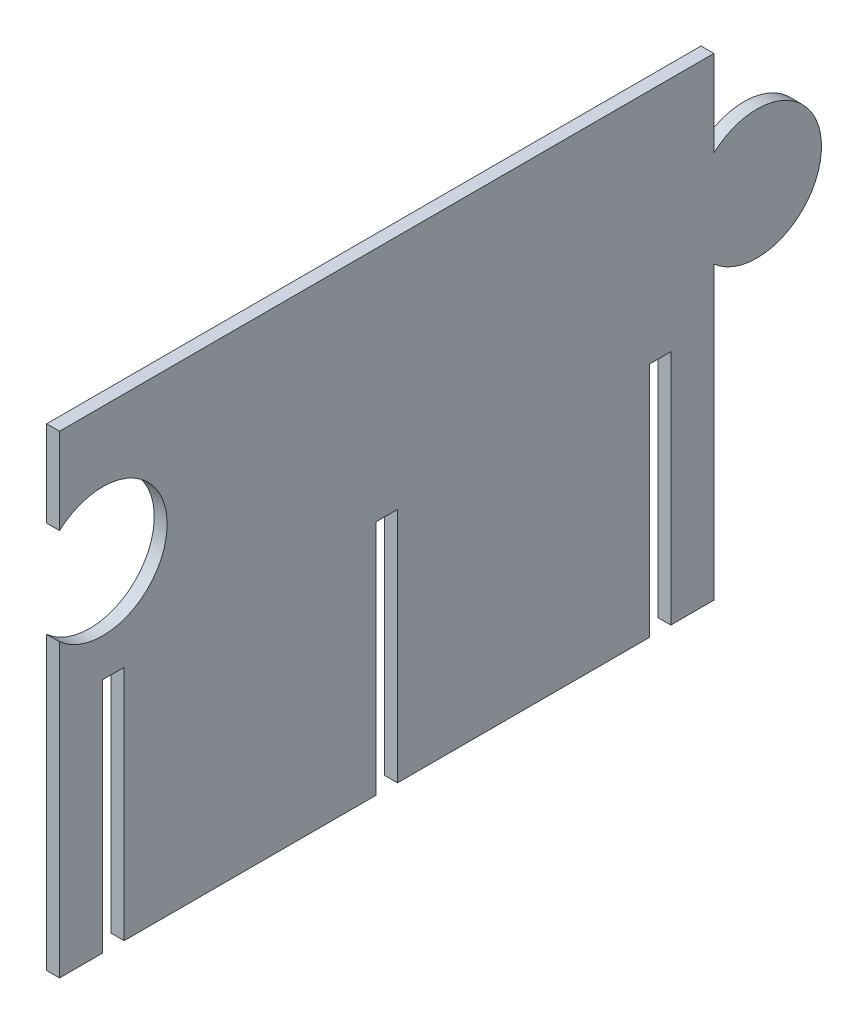
ISO-10303-21;
HEADER;
FILE_DESCRIPTION(('STEP AP214'),'2;1');
FILE_NAME('part.step','',(''),(''),'','','');
FILE_SCHEMA(('AUTOMOTIVE_DESIGN { 1 0 10303 214 1 1 1 1 }'));
ENDSEC;
DATA;
#1=APPLICATION_CONTEXT('core data for automotive mechanical design processes');
#2=APPLICATION_PROTOCOL_DEFINITION('international standard','automotive_design',2000,#1);
#3=PRODUCT_CONTEXT('',#1,'mechanical');
#4=PRODUCT('Part','Part','',(#3));
#5=PRODUCT_RELATED_PRODUCT_CATEGORY('part','',(#4));
#6=PRODUCT_DEFINITION_FORMATION('','',#4);
#7=PRODUCT_DEFINITION_CONTEXT('part definition',#1,'design');
#8=PRODUCT_DEFINITION('design','',#6,#7);
#9=PRODUCT_DEFINITION_SHAPE('','',#8);
#10=(LENGTH_UNIT() NAMED_UNIT(*) SI_UNIT(.MILLI.,.METRE.));
#11=(NAMED_UNIT(*) PLANE_ANGLE_UNIT() SI_UNIT($,.RADIAN.));
#12=(NAMED_UNIT(*) SI_UNIT($,.STERADIAN.) SOLID_ANGLE_UNIT());
#13=UNCERTAINTY_MEASURE_WITH_UNIT(LENGTH_MEASURE(1.E-05),#10,'distance_accuracy_value','');
#14=(GEOMETRIC_REPRESENTATION_CONTEXT(3) GLOBAL_UNCERTAINTY_ASSIGNED_CONTEXT((#13)) GLOBAL_UNIT_ASSIGNED_CONTEXT((#10,
#11,#12)) REPRESENTATION_CONTEXT('',''));
#15=CARTESIAN_POINT('',(0.,0.,0.));
#16=DIRECTION('',(0.,0.,1.));
#17=DIRECTION('',(1.,0.,0.));
#18=AXIS2_PLACEMENT_3D('',#15,#16,#17);
#19=CARTESIAN_POINT('',(3.,55.9300406372922,-141.990840374598));
#20=DIRECTION('',(-1.,0.,0.));
#21=DIRECTION('',(0.,0.,1.));
#22=AXIS2_PLACEMENT_3D('',#19,#20,#21);
#23=CYLINDRICAL_SURFACE('',#22,15.);
#24=CARTESIAN_POINT('',(0.,55.9300406372922,-141.990840374598));
#25=DIRECTION('',(-1.,0.,0.));
#26=DIRECTION('',(0.,0.,1.));
#27=AXIS2_PLACEMENT_3D('',#24,#25,#26);
#28=CIRCLE('',#27,15.);
#29=CARTESIAN_POINT('',(0.,67.1103805247912,-131.990840374598));
#30=VERTEX_POINT('',#29);
#31=CARTESIAN_POINT('',(0.,44.7497007497933,-131.990840374598));
#32=VERTEX_POINT('',#31);
#33=EDGE_CURVE('E200',#30,#32,#28,.T.);
#34=ORIENTED_EDGE('',*,*,#33,.F.);
#35=DIRECTION('',(-1.,0.,0.));
#36=VECTOR('',#35,1.);
#37=CARTESIAN_POINT('',(3.,67.1103805247912,-131.990840374598));
#38=LINE('',#37,#36);
#39=CARTESIAN_POINT('',(3.,67.1103805247912,-131.990840374598));
#40=VERTEX_POINT('',#39);
#41=EDGE_CURVE('E11',#40,#30,#38,.T.);
#42=ORIENTED_EDGE('',*,*,#41,.F.);
#43=CARTESIAN_POINT('',(3.,55.9300406372922,-141.990840374598));
#44=DIRECTION('',(-1.,0.,0.));
#45=DIRECTION('',(0.,0.,1.));
#46=AXIS2_PLACEMENT_3D('',#43,#44,#45);
#47=CIRCLE('',#46,15.);
#48=CARTESIAN_POINT('',(3.,44.7497007497933,-131.990840374598));
#49=VERTEX_POINT('',#48);
#50=EDGE_CURVE('E242',#40,#49,#47,.T.);
#51=ORIENTED_EDGE('',*,*,#50,.T.);
#52=DIRECTION('',(-1.,0.,0.));
#53=VECTOR('',#52,1.);
#54=CARTESIAN_POINT('',(3.,44.7497007497933,-131.990840374598));
#55=LINE('',#54,#53);
#56=EDGE_CURVE('E35',#49,#32,#55,.T.);
#57=ORIENTED_EDGE('',*,*,#56,.T.);
#58=EDGE_LOOP('',(#34,#42,#51,#57));
#59=FACE_BOUND('',#58,.T.);
#60=ADVANCED_FACE('F32',(#59),#23,.T.);
#61=CARTESIAN_POINT('',(3.,87.1103805247912,-131.990840374598));
#62=DIRECTION('',(0.,0.,-1.));
#63=DIRECTION('',(-1.,0.,0.));
#64=AXIS2_PLACEMENT_3D('',#61,#62,#63);
#65=PLANE('',#64);
#66=DIRECTION('',(0.,-1.,0.));
#67=VECTOR('',#66,1.);
#68=CARTESIAN_POINT('',(0.,87.1103805247912,-131.990840374598));
#69=LINE('',#68,#67);
#70=CARTESIAN_POINT('',(0.,87.1103805247912,-131.990840374598));
#71=VERTEX_POINT('',#70);
#72=EDGE_CURVE('E240',#71,#30,#69,.T.);
#73=ORIENTED_EDGE('',*,*,#72,.F.);
#74=DIRECTION('',(-1.,0.,0.));
#75=VECTOR('',#74,1.);
#76=CARTESIAN_POINT('',(3.,87.1103805247912,-131.990840374598));
#77=LINE('',#76,#75);
#78=CARTESIAN_POINT('',(3.,87.1103805247912,-131.990840374598));
#79=VERTEX_POINT('',#78);
#80=EDGE_CURVE('E41',#79,#71,#77,.T.);
#81=ORIENTED_EDGE('',*,*,#80,.F.);
#82=DIRECTION('',(0.,-1.,0.));
#83=VECTOR('',#82,1.);
#84=CARTESIAN_POINT('',(3.,87.1103805247912,-131.990840374598));
#85=LINE('',#84,#83);
#86=EDGE_CURVE('E180',#79,#40,#85,.T.);
#87=ORIENTED_EDGE('',*,*,#86,.T.);
#88=ORIENTED_EDGE('',*,*,#41,.T.);
#89=EDGE_LOOP('',(#73,#81,#87,#88));
#90=FACE_BOUND('',#89,.T.);
#91=ADVANCED_FACE('F293',(#90),#65,.T.);
#92=CARTESIAN_POINT('',(3.,87.1103805247912,-131.990840374598));
#93=DIRECTION('',(0.,-1.,0.));
#94=DIRECTION('',(0.,0.,-1.));
#95=AXIS2_PLACEMENT_3D('',#92,#93,#94);
#96=PLANE('',#95);
#97=DIRECTION('',(0.,0.,1.));
#98=VECTOR('',#97,1.);
#99=CARTESIAN_POINT('',(0.,87.1103805247912,-131.990840374598));
#100=LINE('',#99,#98);
#101=CARTESIAN_POINT('',(0.,87.1103805247911,20.0091596254017));
#102=VERTEX_POINT('',#101);
#103=EDGE_CURVE('E185',#71,#102,#100,.T.);
#104=ORIENTED_EDGE('',*,*,#103,.T.);
#105=DIRECTION('',(-1.,0.,0.));
#106=VECTOR('',#105,1.);
#107=CARTESIAN_POINT('',(3.,87.1103805247911,20.0091596254017));
#108=LINE('',#107,#106);
#109=CARTESIAN_POINT('',(3.,87.1103805247911,20.0091596254017));
#110=VERTEX_POINT('',#109);
#111=EDGE_CURVE('E183',#110,#102,#108,.T.);
#112=ORIENTED_EDGE('',*,*,#111,.F.);
#113=DIRECTION('',(0.,0.,1.));
#114=VECTOR('',#113,1.);
#115=CARTESIAN_POINT('',(3.,87.1103805247912,-131.990840374598));
#116=LINE('',#115,#114);
#117=EDGE_CURVE('E174',#79,#110,#116,.T.);
#118=ORIENTED_EDGE('',*,*,#117,.F.);
#119=ORIENTED_EDGE('',*,*,#80,.T.);
#120=EDGE_LOOP('',(#104,#112,#118,#119));
#121=FACE_BOUND('',#120,.T.);
#122=ADVANCED_FACE('F184',(#121),#96,.F.);
#123=CARTESIAN_POINT('',(3.,87.1103805247911,20.0091596254017));
#124=DIRECTION('',(0.,0.,-1.));
#125=DIRECTION('',(-1.,0.,0.));
#126=AXIS2_PLACEMENT_3D('',#123,#124,#125);
#127=PLANE('',#126);
#128=DIRECTION('',(0.,-1.,0.));
#129=VECTOR('',#128,1.);
#130=CARTESIAN_POINT('',(0.,87.1103805247911,20.0091596254017));
#131=LINE('',#130,#129);
#132=CARTESIAN_POINT('',(0.,67.1103805247911,20.0091596254017));
#133=VERTEX_POINT('',#132);
#134=EDGE_CURVE('E237',#102,#133,#131,.T.);
#135=ORIENTED_EDGE('',*,*,#134,.T.);
#136=DIRECTION('',(-1.,0.,0.));
#137=VECTOR('',#136,1.);
#138=CARTESIAN_POINT('',(3.,67.1103805247911,20.0091596254017));
#139=LINE('',#138,#137);
#140=CARTESIAN_POINT('',(3.,67.1103805247911,20.0091596254017));
#141=VERTEX_POINT('',#140);
#142=EDGE_CURVE('E188',#141,#133,#139,.T.);
#143=ORIENTED_EDGE('',*,*,#142,.F.);
#144=DIRECTION('',(0.,-1.,0.));
#145=VECTOR('',#144,1.);
#146=CARTESIAN_POINT('',(3.,87.1103805247911,20.0091596254017));
#147=LINE('',#146,#145);
#148=EDGE_CURVE('E178',#110,#141,#147,.T.);
#149=ORIENTED_EDGE('',*,*,#148,.F.);
#150=ORIENTED_EDGE('',*,*,#111,.T.);
#151=EDGE_LOOP('',(#135,#143,#149,#150));
#152=FACE_BOUND('',#151,.T.);
#153=ADVANCED_FACE('F190',(#152),#127,.F.);
#154=CARTESIAN_POINT('',(3.,55.9300406372922,10.0091596254017));
#155=DIRECTION('',(-1.,0.,0.));
#156=DIRECTION('',(0.,0.,1.));
#157=AXIS2_PLACEMENT_3D('',#154,#155,#156);
#158=CYLINDRICAL_SURFACE('',#157,15.);
#159=CARTESIAN_POINT('',(0.,55.9300406372922,10.0091596254017));
#160=DIRECTION('',(-1.,0.,0.));
#161=DIRECTION('',(0.,0.,1.));
#162=AXIS2_PLACEMENT_3D('',#159,#160,#161);
#163=CIRCLE('',#162,15.);
#164=CARTESIAN_POINT('',(0.,44.7497007497932,20.0091596254018));
#165=VERTEX_POINT('',#164);
#166=EDGE_CURVE('E235',#133,#165,#163,.T.);
#167=ORIENTED_EDGE('',*,*,#166,.T.);
#168=DIRECTION('',(-1.,0.,0.));
#169=VECTOR('',#168,1.);
#170=CARTESIAN_POINT('',(3.,44.7497007497932,20.0091596254018));
#171=LINE('',#170,#169);
#172=CARTESIAN_POINT('',(3.,44.7497007497932,20.0091596254018));
#173=VERTEX_POINT('',#172);
#174=EDGE_CURVE('E246',#173,#165,#171,.T.);
#175=ORIENTED_EDGE('',*,*,#174,.F.);
#176=CARTESIAN_POINT('',(3.,55.9300406372922,10.0091596254017));
#177=DIRECTION('',(-1.,0.,0.));
#178=DIRECTION('',(0.,0.,1.));
#179=AXIS2_PLACEMENT_3D('',#176,#177,#178);
#180=CIRCLE('',#179,15.);
#181=EDGE_CURVE('E193',#141,#173,#180,.T.);
#182=ORIENTED_EDGE('',*,*,#181,.F.);
#183=ORIENTED_EDGE('',*,*,#142,.T.);
#184=EDGE_LOOP('',(#167,#175,#182,#183));
#185=FACE_BOUND('',#184,.T.);
#186=ADVANCED_FACE('F306',(#185),#158,.F.);
#187=CARTESIAN_POINT('',(3.,44.7497007497932,20.0091596254018));
#188=DIRECTION('',(0.,0.,-1.));
#189=DIRECTION('',(0.,1.,0.));
#190=AXIS2_PLACEMENT_3D('',#187,#188,#189);
#191=PLANE('',#190);
#192=DIRECTION('',(0.,-1.,0.));
#193=VECTOR('',#192,1.);
#194=CARTESIAN_POINT('',(0.,44.7497007497932,20.0091596254018));
#195=LINE('',#194,#193);
#196=CARTESIAN_POINT('',(0.,-22.8896194752089,20.0091596254018));
#197=VERTEX_POINT('',#196);
#198=EDGE_CURVE('E233',#165,#197,#195,.T.);
#199=ORIENTED_EDGE('',*,*,#198,.T.);
#200=DIRECTION('',(-1.,0.,0.));
#201=VECTOR('',#200,1.);
#202=CARTESIAN_POINT('',(3.,-22.8896194752089,20.0091596254018));
#203=LINE('',#202,#201);
#204=CARTESIAN_POINT('',(3.,-22.8896194752089,20.0091596254018));
#205=VERTEX_POINT('',#204);
#206=EDGE_CURVE('E249',#205,#197,#203,.T.);
#207=ORIENTED_EDGE('',*,*,#206,.F.);
#208=DIRECTION('',(0.,-1.,0.));
#209=VECTOR('',#208,1.);
#210=CARTESIAN_POINT('',(3.,44.7497007497932,20.0091596254018));
#211=LINE('',#210,#209);
#212=EDGE_CURVE('E195',#173,#205,#211,.T.);
#213=ORIENTED_EDGE('',*,*,#212,.F.);
#214=ORIENTED_EDGE('',*,*,#174,.T.);
#215=EDGE_LOOP('',(#199,#207,#213,#214));
#216=FACE_BOUND('',#215,.T.);
#217=ADVANCED_FACE('F309',(#216),#191,.F.);
#218=CARTESIAN_POINT('',(3.,-22.8896194752089,20.0091596254018));
#219=DIRECTION('',(0.,1.,0.));
#220=DIRECTION('',(0.,0.,1.));
#221=AXIS2_PLACEMENT_3D('',#218,#219,#220);
#222=PLANE('',#221);
#223=DIRECTION('',(0.,0.,-1.));
#224=VECTOR('',#223,1.);
#225=CARTESIAN_POINT('',(0.,-22.8896194752089,20.0091596254018));
#226=LINE('',#225,#224);
#227=CARTESIAN_POINT('',(0.,-22.8896194752089,10.0091596254018));
#228=VERTEX_POINT('',#227);
#229=EDGE_CURVE('E231',#197,#228,#226,.T.);
#230=ORIENTED_EDGE('',*,*,#229,.T.);
#231=DIRECTION('',(-1.,0.,0.));
#232=VECTOR('',#231,1.);
#233=CARTESIAN_POINT('',(3.,-22.8896194752089,10.0091596254018));
#234=LINE('',#233,#232);
#235=CARTESIAN_POINT('',(3.,-22.8896194752089,10.0091596254018));
#236=VERTEX_POINT('',#235);
#237=EDGE_CURVE('E252',#236,#228,#234,.T.);
#238=ORIENTED_EDGE('',*,*,#237,.F.);
#239=DIRECTION('',(0.,0.,-1.));
#240=VECTOR('',#239,1.);
#241=CARTESIAN_POINT('',(3.,-22.8896194752089,20.0091596254018));
#242=LINE('',#241,#240);
#243=EDGE_CURVE('E546',#205,#236,#242,.T.);
#244=ORIENTED_EDGE('',*,*,#243,.F.);
#245=ORIENTED_EDGE('',*,*,#206,.T.);
#246=EDGE_LOOP('',(#230,#238,#244,#245));
#247=FACE_BOUND('',#246,.T.);
#248=ADVANCED_FACE('F313',(#247),#222,.F.);
#249=CARTESIAN_POINT('',(3.,-22.8896194752089,10.0091596254018));
#250=DIRECTION('',(0.,0.,1.));
#251=DIRECTION('',(0.,-1.,0.));
#252=AXIS2_PLACEMENT_3D('',#249,#250,#251);
#253=PLANE('',#252);
#254=DIRECTION('',(0.,1.,0.));
#255=VECTOR('',#254,1.);
#256=CARTESIAN_POINT('',(0.,-22.8896194752089,10.0091596254018));
#257=LINE('',#256,#255);
#258=CARTESIAN_POINT('',(0.,32.1103805247911,10.0091596254018));
#259=VERTEX_POINT('',#258);
#260=EDGE_CURVE('E229',#228,#259,#257,.T.);
#261=ORIENTED_EDGE('',*,*,#260,.T.);
#262=DIRECTION('',(-1.,0.,0.));
#263=VECTOR('',#262,1.);
#264=CARTESIAN_POINT('',(3.,32.1103805247911,10.0091596254018));
#265=LINE('',#264,#263);
#266=CARTESIAN_POINT('',(3.,32.1103805247911,10.0091596254018));
#267=VERTEX_POINT('',#266);
#268=EDGE_CURVE('E255',#267,#259,#265,.T.);
#269=ORIENTED_EDGE('',*,*,#268,.F.);
#270=DIRECTION('',(0.,1.,0.));
#271=VECTOR('',#270,1.);
#272=CARTESIAN_POINT('',(3.,-22.8896194752089,10.0091596254018));
#273=LINE('',#272,#271);
#274=EDGE_CURVE('E543',#236,#267,#273,.T.);
#275=ORIENTED_EDGE('',*,*,#274,.F.);
#276=ORIENTED_EDGE('',*,*,#237,.T.);
#277=EDGE_LOOP('',(#261,#269,#275,#276));
#278=FACE_BOUND('',#277,.T.);
#279=ADVANCED_FACE('F317',(#278),#253,.F.);
#280=CARTESIAN_POINT('',(3.,32.1103805247911,10.0091596254018));
#281=DIRECTION('',(0.,1.,0.));
#282=DIRECTION('',(0.,0.,1.));
#283=AXIS2_PLACEMENT_3D('',#280,#281,#282);
#284=PLANE('',#283);
#285=DIRECTION('',(0.,0.,-1.));
#286=VECTOR('',#285,1.);
#287=CARTESIAN_POINT('',(0.,32.1103805247911,10.0091596254018));
#288=LINE('',#287,#286);
#289=CARTESIAN_POINT('',(0.,32.1103805247911,5.00915962540178));
#290=VERTEX_POINT('',#289);
#291=EDGE_CURVE('E227',#259,#290,#288,.T.);
#292=ORIENTED_EDGE('',*,*,#291,.T.);
#293=DIRECTION('',(-1.,0.,0.));
#294=VECTOR('',#293,1.);
#295=CARTESIAN_POINT('',(3.,32.1103805247911,5.00915962540178));
#296=LINE('',#295,#294);
#297=CARTESIAN_POINT('',(3.,32.1103805247911,5.00915962540178));
#298=VERTEX_POINT('',#297);
#299=EDGE_CURVE('E258',#298,#290,#296,.T.);
#300=ORIENTED_EDGE('',*,*,#299,.F.);
#301=DIRECTION('',(0.,0.,-1.));
#302=VECTOR('',#301,1.);
#303=CARTESIAN_POINT('',(3.,32.1103805247911,10.0091596254018));
#304=LINE('',#303,#302);
#305=EDGE_CURVE('E541',#267,#298,#304,.T.);
#306=ORIENTED_EDGE('',*,*,#305,.F.);
#307=ORIENTED_EDGE('',*,*,#268,.T.);
#308=EDGE_LOOP('',(#292,#300,#306,#307));
#309=FACE_BOUND('',#308,.T.);
#310=ADVANCED_FACE('F321',(#309),#284,.F.);
#311=CARTESIAN_POINT('',(3.,32.1103805247911,5.00915962540178));
#312=DIRECTION('',(0.,0.,-1.));
#313=DIRECTION('',(0.,1.,0.));
#314=AXIS2_PLACEMENT_3D('',#311,#312,#313);
#315=PLANE('',#314);
#316=DIRECTION('',(0.,-1.,0.));
#317=VECTOR('',#316,1.);
#318=CARTESIAN_POINT('',(0.,32.1103805247911,5.00915962540178));
#319=LINE('',#318,#317);
#320=CARTESIAN_POINT('',(0.,-22.8896194752089,5.00915962540175));
#321=VERTEX_POINT('',#320);
#322=EDGE_CURVE('E225',#290,#321,#319,.T.);
#323=ORIENTED_EDGE('',*,*,#322,.T.);
#324=DIRECTION('',(-1.,0.,0.));
#325=VECTOR('',#324,1.);
#326=CARTESIAN_POINT('',(3.,-22.8896194752089,5.00915962540175));
#327=LINE('',#326,#325);
#328=CARTESIAN_POINT('',(3.,-22.8896194752089,5.00915962540175));
#329=VERTEX_POINT('',#328);
#330=EDGE_CURVE('E261',#329,#321,#327,.T.);
#331=ORIENTED_EDGE('',*,*,#330,.F.);
#332=DIRECTION('',(0.,-1.,0.));
#333=VECTOR('',#332,1.);
#334=CARTESIAN_POINT('',(3.,32.1103805247911,5.00915962540178));
#335=LINE('',#334,#333);
#336=EDGE_CURVE('E534',#298,#329,#335,.T.);
#337=ORIENTED_EDGE('',*,*,#336,.F.);
#338=ORIENTED_EDGE('',*,*,#299,.T.);
#339=EDGE_LOOP('',(#323,#331,#337,#338));
#340=FACE_BOUND('',#339,.T.);
#341=ADVANCED_FACE('F325',(#340),#315,.F.);
#342=CARTESIAN_POINT('',(3.,-22.8896194752089,5.00915962540175));
#343=DIRECTION('',(0.,1.,0.));
#344=DIRECTION('',(0.,0.,1.));
#345=AXIS2_PLACEMENT_3D('',#342,#343,#344);
#346=PLANE('',#345);
#347=DIRECTION('',(0.,0.,-1.));
#348=VECTOR('',#347,1.);
#349=CARTESIAN_POINT('',(0.,-22.8896194752089,5.00915962540175));
#350=LINE('',#349,#348);
#351=CARTESIAN_POINT('',(0.,-22.8896194752088,-53.4908403745983));
#352=VERTEX_POINT('',#351);
#353=EDGE_CURVE('E223',#321,#352,#350,.T.);
#354=ORIENTED_EDGE('',*,*,#353,.T.);
#355=DIRECTION('',(-1.,0.,0.));
#356=VECTOR('',#355,1.);
#357=CARTESIAN_POINT('',(3.,-22.8896194752088,-53.4908403745983));
#358=LINE('',#357,#356);
#359=CARTESIAN_POINT('',(3.,-22.8896194752088,-53.4908403745983));
#360=VERTEX_POINT('',#359);
#361=EDGE_CURVE('E264',#360,#352,#358,.T.);
#362=ORIENTED_EDGE('',*,*,#361,.F.);
#363=DIRECTION('',(0.,0.,-1.));
#364=VECTOR('',#363,1.);
#365=CARTESIAN_POINT('',(3.,-22.8896194752089,5.00915962540175));
#366=LINE('',#365,#364);
#367=EDGE_CURVE('E531',#329,#360,#366,.T.);
#368=ORIENTED_EDGE('',*,*,#367,.F.);
#369=ORIENTED_EDGE('',*,*,#330,.T.);
#370=EDGE_LOOP('',(#354,#362,#368,#369));
#371=FACE_BOUND('',#370,.T.);
#372=ADVANCED_FACE('F329',(#371),#346,.F.);
#373=CARTESIAN_POINT('',(3.,-22.8896194752088,-53.4908403745983));
#374=DIRECTION('',(0.,0.,1.));
#375=DIRECTION('',(0.,-1.,0.));
#376=AXIS2_PLACEMENT_3D('',#373,#374,#375);
#377=PLANE('',#376);
#378=DIRECTION('',(0.,1.,0.));
#379=VECTOR('',#378,1.);
#380=CARTESIAN_POINT('',(0.,-22.8896194752088,-53.4908403745983));
#381=LINE('',#380,#379);
#382=CARTESIAN_POINT('',(0.,32.1103805247911,-53.4908403745982));
#383=VERTEX_POINT('',#382);
#384=EDGE_CURVE('E221',#352,#383,#381,.T.);
#385=ORIENTED_EDGE('',*,*,#384,.T.);
#386=DIRECTION('',(-1.,0.,0.));
#387=VECTOR('',#386,1.);
#388=CARTESIAN_POINT('',(3.,32.1103805247911,-53.4908403745982));
#389=LINE('',#388,#387);
#390=CARTESIAN_POINT('',(3.,32.1103805247911,-53.4908403745982));
#391=VERTEX_POINT('',#390);
#392=EDGE_CURVE('E267',#391,#383,#389,.T.);
#393=ORIENTED_EDGE('',*,*,#392,.F.);
#394=DIRECTION('',(0.,1.,0.));
#395=VECTOR('',#394,1.);
#396=CARTESIAN_POINT('',(3.,-22.8896194752088,-53.4908403745983));
#397=LINE('',#396,#395);
#398=EDGE_CURVE('E529',#360,#391,#397,.T.);
#399=ORIENTED_EDGE('',*,*,#398,.F.);
#400=ORIENTED_EDGE('',*,*,#361,.T.);
#401=EDGE_LOOP('',(#385,#393,#399,#400));
#402=FACE_BOUND('',#401,.T.);
#403=ADVANCED_FACE('F333',(#402),#377,.F.);
#404=CARTESIAN_POINT('',(3.,32.1103805247911,-53.4908403745982));
#405=DIRECTION('',(0.,1.,0.));
#406=DIRECTION('',(0.,0.,1.));
#407=AXIS2_PLACEMENT_3D('',#404,#405,#406);
#408=PLANE('',#407);
#409=DIRECTION('',(0.,0.,-1.));
#410=VECTOR('',#409,1.);
#411=CARTESIAN_POINT('',(0.,32.1103805247911,-53.4908403745982));
#412=LINE('',#411,#410);
#413=CARTESIAN_POINT('',(0.,32.1103805247911,-58.4908403745982));
#414=VERTEX_POINT('',#413);
#415=EDGE_CURVE('E219',#383,#414,#412,.T.);
#416=ORIENTED_EDGE('',*,*,#415,.T.);
#417=DIRECTION('',(-1.,0.,0.));
#418=VECTOR('',#417,1.);
#419=CARTESIAN_POINT('',(3.,32.1103805247911,-58.4908403745982));
#420=LINE('',#419,#418);
#421=CARTESIAN_POINT('',(3.,32.1103805247911,-58.4908403745982));
#422=VERTEX_POINT('',#421);
#423=EDGE_CURVE('E270',#422,#414,#420,.T.);
#424=ORIENTED_EDGE('',*,*,#423,.F.);
#425=DIRECTION('',(0.,0.,-1.));
#426=VECTOR('',#425,1.);
#427=CARTESIAN_POINT('',(3.,32.1103805247911,-53.4908403745982));
#428=LINE('',#427,#426);
#429=EDGE_CURVE('E522',#391,#422,#428,.T.);
#430=ORIENTED_EDGE('',*,*,#429,.F.);
#431=ORIENTED_EDGE('',*,*,#392,.T.);
#432=EDGE_LOOP('',(#416,#424,#430,#431));
#433=FACE_BOUND('',#432,.T.);
#434=ADVANCED_FACE('F337',(#433),#408,.F.);
#435=CARTESIAN_POINT('',(3.,32.1103805247911,-58.4908403745982));
#436=DIRECTION('',(0.,0.,-1.));
#437=DIRECTION('',(0.,1.,0.));
#438=AXIS2_PLACEMENT_3D('',#435,#436,#437);
#439=PLANE('',#438);
#440=DIRECTION('',(0.,-1.,0.));
#441=VECTOR('',#440,1.);
#442=CARTESIAN_POINT('',(0.,32.1103805247911,-58.4908403745982));
#443=LINE('',#442,#441);
#444=CARTESIAN_POINT('',(0.,-22.8896194752088,-58.4908403745982));
#445=VERTEX_POINT('',#444);
#446=EDGE_CURVE('E217',#414,#445,#443,.T.);
#447=ORIENTED_EDGE('',*,*,#446,.T.);
#448=DIRECTION('',(-1.,0.,0.));
#449=VECTOR('',#448,1.);
#450=CARTESIAN_POINT('',(3.,-22.8896194752088,-58.4908403745982));
#451=LINE('',#450,#449);
#452=CARTESIAN_POINT('',(3.,-22.8896194752088,-58.4908403745982));
#453=VERTEX_POINT('',#452);
#454=EDGE_CURVE('E273',#453,#445,#451,.T.);
#455=ORIENTED_EDGE('',*,*,#454,.F.);
#456=DIRECTION('',(0.,-1.,0.));
#457=VECTOR('',#456,1.);
#458=CARTESIAN_POINT('',(3.,32.1103805247911,-58.4908403745982));
#459=LINE('',#458,#457);
#460=EDGE_CURVE('E519',#422,#453,#459,.T.);
#461=ORIENTED_EDGE('',*,*,#460,.F.);
#462=ORIENTED_EDGE('',*,*,#423,.T.);
#463=EDGE_LOOP('',(#447,#455,#461,#462));
#464=FACE_BOUND('',#463,.T.);
#465=ADVANCED_FACE('F341',(#464),#439,.F.);
#466=CARTESIAN_POINT('',(3.,-22.8896194752088,-58.4908403745982));
#467=DIRECTION('',(0.,1.,0.));
#468=DIRECTION('',(0.,0.,1.));
#469=AXIS2_PLACEMENT_3D('',#466,#467,#468);
#470=PLANE('',#469);
#471=DIRECTION('',(0.,0.,-1.));
#472=VECTOR('',#471,1.);
#473=CARTESIAN_POINT('',(0.,-22.8896194752088,-58.4908403745982));
#474=LINE('',#473,#472);
#475=CARTESIAN_POINT('',(0.,-22.8896194752088,-116.990840374598));
#476=VERTEX_POINT('',#475);
#477=EDGE_CURVE('E215',#445,#476,#474,.T.);
#478=ORIENTED_EDGE('',*,*,#477,.T.);
#479=DIRECTION('',(-1.,0.,0.));
#480=VECTOR('',#479,1.);
#481=CARTESIAN_POINT('',(3.,-22.8896194752088,-116.990840374598));
#482=LINE('',#481,#480);
#483=CARTESIAN_POINT('',(3.,-22.8896194752088,-116.990840374598));
#484=VERTEX_POINT('',#483);
#485=EDGE_CURVE('E276',#484,#476,#482,.T.);
#486=ORIENTED_EDGE('',*,*,#485,.F.);
#487=DIRECTION('',(0.,0.,-1.));
#488=VECTOR('',#487,1.);
#489=CARTESIAN_POINT('',(3.,-22.8896194752088,-58.4908403745982));
#490=LINE('',#489,#488);
#491=EDGE_CURVE('E517',#453,#484,#490,.T.);
#492=ORIENTED_EDGE('',*,*,#491,.F.);
#493=ORIENTED_EDGE('',*,*,#454,.T.);
#494=EDGE_LOOP('',(#478,#486,#492,#493));
#495=FACE_BOUND('',#494,.T.);
#496=ADVANCED_FACE('F345',(#495),#470,.F.);
#497=CARTESIAN_POINT('',(3.,-22.8896194752088,-116.990840374598));
#498=DIRECTION('',(0.,0.,1.));
#499=DIRECTION('',(0.,-1.,0.));
#500=AXIS2_PLACEMENT_3D('',#497,#498,#499);
#501=PLANE('',#500);
#502=DIRECTION('',(0.,1.,0.));
#503=VECTOR('',#502,1.);
#504=CARTESIAN_POINT('',(0.,-22.8896194752088,-116.990840374598));
#505=LINE('',#504,#503);
#506=CARTESIAN_POINT('',(0.,32.1103805247911,-116.990840374598));
#507=VERTEX_POINT('',#506);
#508=EDGE_CURVE('E213',#476,#507,#505,.T.);
#509=ORIENTED_EDGE('',*,*,#508,.T.);
#510=DIRECTION('',(-1.,0.,0.));
#511=VECTOR('',#510,1.);
#512=CARTESIAN_POINT('',(3.,32.1103805247911,-116.990840374598));
#513=LINE('',#512,#511);
#514=CARTESIAN_POINT('',(3.,32.1103805247911,-116.990840374598));
#515=VERTEX_POINT('',#514);
#516=EDGE_CURVE('E279',#515,#507,#513,.T.);
#517=ORIENTED_EDGE('',*,*,#516,.F.);
#518=DIRECTION('',(0.,1.,0.));
#519=VECTOR('',#518,1.);
#520=CARTESIAN_POINT('',(3.,-22.8896194752088,-116.990840374598));
#521=LINE('',#520,#519);
#522=EDGE_CURVE('E510',#484,#515,#521,.T.);
#523=ORIENTED_EDGE('',*,*,#522,.F.);
#524=ORIENTED_EDGE('',*,*,#485,.T.);
#525=EDGE_LOOP('',(#509,#517,#523,#524));
#526=FACE_BOUND('',#525,.T.);
#527=ADVANCED_FACE('F349',(#526),#501,.F.);
#528=CARTESIAN_POINT('',(3.,32.1103805247911,-116.990840374598));
#529=DIRECTION('',(0.,1.,0.));
#530=DIRECTION('',(0.,0.,1.));
#531=AXIS2_PLACEMENT_3D('',#528,#529,#530);
#532=PLANE('',#531);
#533=DIRECTION('',(0.,0.,-1.));
#534=VECTOR('',#533,1.);
#535=CARTESIAN_POINT('',(0.,32.1103805247911,-116.990840374598));
#536=LINE('',#535,#534);
#537=CARTESIAN_POINT('',(0.,32.1103805247911,-121.990840374598));
#538=VERTEX_POINT('',#537);
#539=EDGE_CURVE('E211',#507,#538,#536,.T.);
#540=ORIENTED_EDGE('',*,*,#539,.T.);
#541=DIRECTION('',(-1.,0.,0.));
#542=VECTOR('',#541,1.);
#543=CARTESIAN_POINT('',(3.,32.1103805247911,-121.990840374598));
#544=LINE('',#543,#542);
#545=CARTESIAN_POINT('',(3.,32.1103805247911,-121.990840374598));
#546=VERTEX_POINT('',#545);
#547=EDGE_CURVE('E282',#546,#538,#544,.T.);
#548=ORIENTED_EDGE('',*,*,#547,.F.);
#549=DIRECTION('',(0.,0.,-1.));
#550=VECTOR('',#549,1.);
#551=CARTESIAN_POINT('',(3.,32.1103805247911,-116.990840374598));
#552=LINE('',#551,#550);
#553=EDGE_CURVE('E507',#515,#546,#552,.T.);
#554=ORIENTED_EDGE('',*,*,#553,.F.);
#555=ORIENTED_EDGE('',*,*,#516,.T.);
#556=EDGE_LOOP('',(#540,#548,#554,#555));
#557=FACE_BOUND('',#556,.T.);
#558=ADVANCED_FACE('F353',(#557),#532,.F.);
#559=CARTESIAN_POINT('',(3.,32.1103805247911,-121.990840374598));
#560=DIRECTION('',(0.,0.,-1.));
#561=DIRECTION('',(0.,1.,0.));
#562=AXIS2_PLACEMENT_3D('',#559,#560,#561);
#563=PLANE('',#562);
#564=DIRECTION('',(0.,-1.,0.));
#565=VECTOR('',#564,1.);
#566=CARTESIAN_POINT('',(0.,32.1103805247911,-121.990840374598));
#567=LINE('',#566,#565);
#568=CARTESIAN_POINT('',(0.,-22.8896194752088,-121.990840374598));
#569=VERTEX_POINT('',#568);
#570=EDGE_CURVE('E209',#538,#569,#567,.T.);
#571=ORIENTED_EDGE('',*,*,#570,.T.);
#572=DIRECTION('',(-1.,0.,0.));
#573=VECTOR('',#572,1.);
#574=CARTESIAN_POINT('',(3.,-22.8896194752088,-121.990840374598));
#575=LINE('',#574,#573);
#576=CARTESIAN_POINT('',(3.,-22.8896194752088,-121.990840374598));
#577=VERTEX_POINT('',#576);
#578=EDGE_CURVE('E285',#577,#569,#575,.T.);
#579=ORIENTED_EDGE('',*,*,#578,.F.);
#580=DIRECTION('',(0.,-1.,0.));
#581=VECTOR('',#580,1.);
#582=CARTESIAN_POINT('',(3.,32.1103805247911,-121.990840374598));
#583=LINE('',#582,#581);
#584=EDGE_CURVE('E505',#546,#577,#583,.T.);
#585=ORIENTED_EDGE('',*,*,#584,.F.);
#586=ORIENTED_EDGE('',*,*,#547,.T.);
#587=EDGE_LOOP('',(#571,#579,#585,#586));
#588=FACE_BOUND('',#587,.T.);
#589=ADVANCED_FACE('F357',(#588),#563,.F.);
#590=CARTESIAN_POINT('',(3.,-22.8896194752088,-121.990840374598));
#591=DIRECTION('',(0.,1.,0.));
#592=DIRECTION('',(0.,0.,1.));
#593=AXIS2_PLACEMENT_3D('',#590,#591,#592);
#594=PLANE('',#593);
#595=DIRECTION('',(0.,0.,-1.));
#596=VECTOR('',#595,1.);
#597=CARTESIAN_POINT('',(0.,-22.8896194752088,-121.990840374598));
#598=LINE('',#597,#596);
#599=CARTESIAN_POINT('',(0.,-22.8896194752088,-131.990840374598));
#600=VERTEX_POINT('',#599);
#601=EDGE_CURVE('E206',#569,#600,#598,.T.);
#602=ORIENTED_EDGE('',*,*,#601,.T.);
#603=DIRECTION('',(-1.,0.,0.));
#604=VECTOR('',#603,1.);
#605=CARTESIAN_POINT('',(3.,-22.8896194752088,-131.990840374598));
#606=LINE('',#605,#604);
#607=CARTESIAN_POINT('',(3.,-22.8896194752088,-131.990840374598));
#608=VERTEX_POINT('',#607);
#609=EDGE_CURVE('E287',#608,#600,#606,.T.);
#610=ORIENTED_EDGE('',*,*,#609,.F.);
#611=DIRECTION('',(0.,0.,-1.));
#612=VECTOR('',#611,1.);
#613=CARTESIAN_POINT('',(3.,-22.8896194752088,-121.990840374598));
#614=LINE('',#613,#612);
#615=EDGE_CURVE('E565',#577,#608,#614,.T.);
#616=ORIENTED_EDGE('',*,*,#615,.F.);
#617=ORIENTED_EDGE('',*,*,#578,.T.);
#618=EDGE_LOOP('',(#602,#610,#616,#617));
#619=FACE_BOUND('',#618,.T.);
#620=ADVANCED_FACE('F361',(#619),#594,.F.);
#621=CARTESIAN_POINT('',(3.,44.7497007497933,-131.990840374598));
#622=DIRECTION('',(0.,0.,-1.));
#623=DIRECTION('',(0.,1.,0.));
#624=AXIS2_PLACEMENT_3D('',#621,#622,#623);
#625=PLANE('',#624);
#626=DIRECTION('',(0.,-1.,0.));
#627=VECTOR('',#626,1.);
#628=CARTESIAN_POINT('',(0.,44.7497007497933,-131.990840374598));
#629=LINE('',#628,#627);
#630=EDGE_CURVE('E203',#32,#600,#629,.T.);
#631=ORIENTED_EDGE('',*,*,#630,.F.);
#632=ORIENTED_EDGE('',*,*,#56,.F.);
#633=DIRECTION('',(0.,-1.,0.));
#634=VECTOR('',#633,1.);
#635=CARTESIAN_POINT('',(3.,44.7497007497933,-131.990840374598));
#636=LINE('',#635,#634);
#637=EDGE_CURVE('E567',#49,#608,#636,.T.);
#638=ORIENTED_EDGE('',*,*,#637,.T.);
#639=ORIENTED_EDGE('',*,*,#609,.T.);
#640=EDGE_LOOP('',(#631,#632,#638,#639));
#641=FACE_BOUND('',#640,.T.);
#642=ADVANCED_FACE('F289',(#641),#625,.T.);
#643=CARTESIAN_POINT('',(3.,55.9300406372922,-141.990840374598));
#644=DIRECTION('',(-1.,0.,0.));
#645=DIRECTION('',(0.,0.,1.));
#646=AXIS2_PLACEMENT_3D('',#643,#644,#645);
#647=PLANE('',#646);
#648=ORIENTED_EDGE('',*,*,#50,.F.);
#649=ORIENTED_EDGE('',*,*,#86,.F.);
#650=ORIENTED_EDGE('',*,*,#117,.T.);
#651=ORIENTED_EDGE('',*,*,#148,.T.);
#652=ORIENTED_EDGE('',*,*,#181,.T.);
#653=ORIENTED_EDGE('',*,*,#212,.T.);
#654=ORIENTED_EDGE('',*,*,#243,.T.);
#655=ORIENTED_EDGE('',*,*,#274,.T.);
#656=ORIENTED_EDGE('',*,*,#305,.T.);
#657=ORIENTED_EDGE('',*,*,#336,.T.);
#658=ORIENTED_EDGE('',*,*,#367,.T.);
#659=ORIENTED_EDGE('',*,*,#398,.T.);
#660=ORIENTED_EDGE('',*,*,#429,.T.);
#661=ORIENTED_EDGE('',*,*,#460,.T.);
#662=ORIENTED_EDGE('',*,*,#491,.T.);
#663=ORIENTED_EDGE('',*,*,#522,.T.);
#664=ORIENTED_EDGE('',*,*,#553,.T.);
#665=ORIENTED_EDGE('',*,*,#584,.T.);
#666=ORIENTED_EDGE('',*,*,#615,.T.);
#667=ORIENTED_EDGE('',*,*,#637,.F.);
#668=EDGE_LOOP('',(#648,#649,#650,#651,#652,#653,#654,#655,#656,#657,#658,#659,#660,#661,#662,
#663,#664,#665,#666,#667));
#669=FACE_BOUND('',#668,.T.);
#670=ADVANCED_FACE('F176',(#669),#647,.F.);
#671=CARTESIAN_POINT('',(0.,55.9300406372922,-141.990840374598));
#672=DIRECTION('',(-1.,0.,0.));
#673=DIRECTION('',(0.,0.,1.));
#674=AXIS2_PLACEMENT_3D('',#671,#672,#673);
#675=PLANE('',#674);
#676=ORIENTED_EDGE('',*,*,#33,.T.);
#677=ORIENTED_EDGE('',*,*,#630,.T.);
#678=ORIENTED_EDGE('',*,*,#601,.F.);
#679=ORIENTED_EDGE('',*,*,#570,.F.);
#680=ORIENTED_EDGE('',*,*,#539,.F.);
#681=ORIENTED_EDGE('',*,*,#508,.F.);
#682=ORIENTED_EDGE('',*,*,#477,.F.);
#683=ORIENTED_EDGE('',*,*,#446,.F.);
#684=ORIENTED_EDGE('',*,*,#415,.F.);
#685=ORIENTED_EDGE('',*,*,#384,.F.);
#686=ORIENTED_EDGE('',*,*,#353,.F.);
#687=ORIENTED_EDGE('',*,*,#322,.F.);
#688=ORIENTED_EDGE('',*,*,#291,.F.);
#689=ORIENTED_EDGE('',*,*,#260,.F.);
#690=ORIENTED_EDGE('',*,*,#229,.F.);
#691=ORIENTED_EDGE('',*,*,#198,.F.);
#692=ORIENTED_EDGE('',*,*,#166,.F.);
#693=ORIENTED_EDGE('',*,*,#134,.F.);
#694=ORIENTED_EDGE('',*,*,#103,.F.);
#695=ORIENTED_EDGE('',*,*,#72,.T.);
#696=EDGE_LOOP('',(#676,#677,#678,#679,#680,#681,#682,#683,#684,#685,#686,#687,#688,#689,#690,
#691,#692,#693,#694,#695));
#697=FACE_BOUND('',#696,.T.);
#698=ADVANCED_FACE('F292',(#697),#675,.T.);
#699=CLOSED_SHELL('',(#60,#91,#122,#153,#186,#217,#248,#279,#310,#341,#372,#403,#434,#465,#496,
#527,#558,#589,#620,#642,#670,#698));
#700=MANIFOLD_SOLID_BREP('B2',#699);
#701=ADVANCED_BREP_SHAPE_REPRESENTATION('',(#18,#700),#14);
#702=SHAPE_DEFINITION_REPRESENTATION(#9,#701);
ENDSEC;
END-ISO-10303-21;
